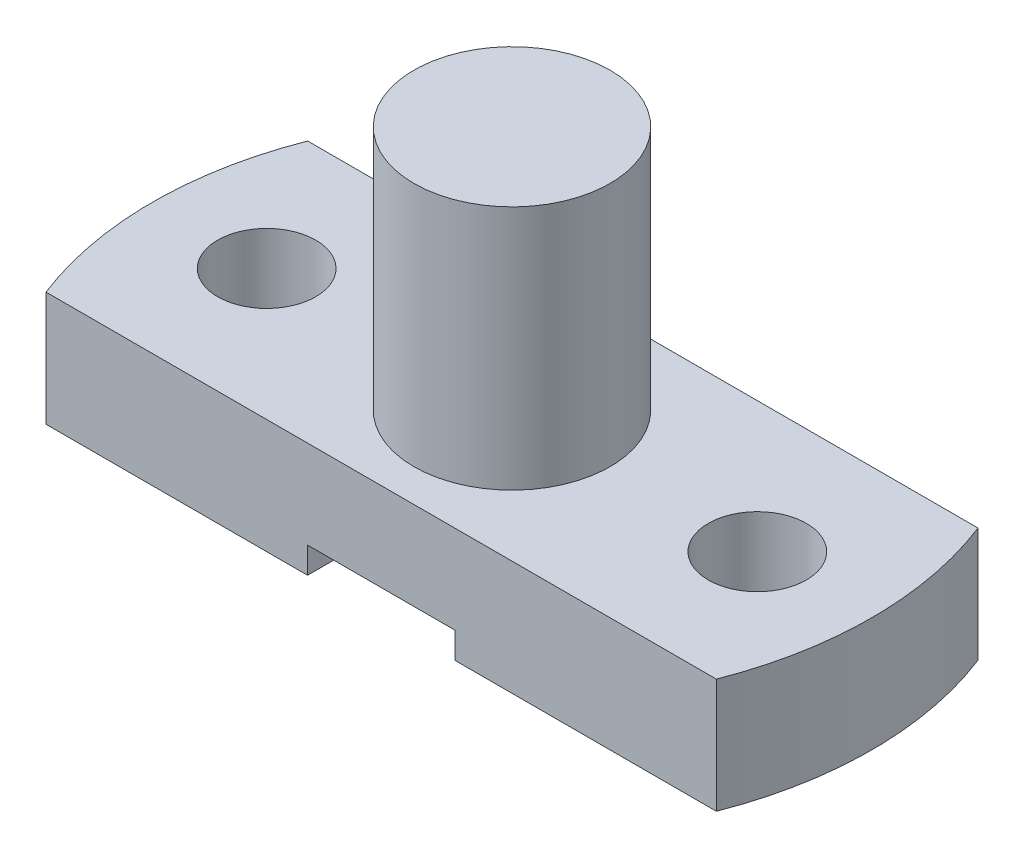
ISO-10303-21;
HEADER;
FILE_DESCRIPTION(('STEP AP214'),'2;1');
FILE_NAME('part.step','',(''),(''),'','','');
FILE_SCHEMA(('AUTOMOTIVE_DESIGN { 1 0 10303 214 1 1 1 1 }'));
ENDSEC;
DATA;
#1=APPLICATION_CONTEXT('core data for automotive mechanical design processes');
#2=APPLICATION_PROTOCOL_DEFINITION('international standard','automotive_design',2000,#1);
#3=PRODUCT_CONTEXT('',#1,'mechanical');
#4=PRODUCT('Part','Part','',(#3));
#5=PRODUCT_RELATED_PRODUCT_CATEGORY('part','',(#4));
#6=PRODUCT_DEFINITION_FORMATION('','',#4);
#7=PRODUCT_DEFINITION_CONTEXT('part definition',#1,'design');
#8=PRODUCT_DEFINITION('design','',#6,#7);
#9=PRODUCT_DEFINITION_SHAPE('','',#8);
#10=(LENGTH_UNIT() NAMED_UNIT(*) SI_UNIT(.MILLI.,.METRE.));
#11=(NAMED_UNIT(*) PLANE_ANGLE_UNIT() SI_UNIT($,.RADIAN.));
#12=(NAMED_UNIT(*) SI_UNIT($,.STERADIAN.) SOLID_ANGLE_UNIT());
#13=UNCERTAINTY_MEASURE_WITH_UNIT(LENGTH_MEASURE(1.E-05),#10,'distance_accuracy_value','');
#14=(GEOMETRIC_REPRESENTATION_CONTEXT(3) GLOBAL_UNCERTAINTY_ASSIGNED_CONTEXT((#13)) GLOBAL_UNIT_ASSIGNED_CONTEXT((#10,
#11,#12)) REPRESENTATION_CONTEXT('',''));
#15=CARTESIAN_POINT('',(0.,0.,0.));
#16=DIRECTION('',(0.,0.,1.));
#17=DIRECTION('',(1.,0.,0.));
#18=AXIS2_PLACEMENT_3D('',#15,#16,#17);
#19=CARTESIAN_POINT('',(0.,0.,0.));
#20=DIRECTION('',(0.,1.,0.));
#21=DIRECTION('',(0.,0.,1.));
#22=AXIS2_PLACEMENT_3D('',#19,#20,#21);
#23=PLANE('',#22);
#24=CARTESIAN_POINT('',(75.,0.,0.));
#25=DIRECTION('',(0.,1.,0.));
#26=DIRECTION('',(0.,0.,1.));
#27=AXIS2_PLACEMENT_3D('',#24,#25,#26);
#28=CIRCLE('',#27,15.);
#29=CARTESIAN_POINT('',(75.,0.,15.));
#30=VERTEX_POINT('',#29);
#31=EDGE_CURVE('E157',#30,#30,#28,.T.);
#32=ORIENTED_EDGE('',*,*,#31,.T.);
#33=EDGE_LOOP('',(#32));
#34=FACE_BOUND('',#33,.T.);
#35=DIRECTION('',(1.,0.,0.));
#36=VECTOR('',#35,1.);
#37=CARTESIAN_POINT('',(-102.469507659596,0.,40.));
#38=LINE('',#37,#36);
#39=CARTESIAN_POINT('',(22.5,0.,40.));
#40=VERTEX_POINT('',#39);
#41=CARTESIAN_POINT('',(102.469507659596,0.,40.));
#42=VERTEX_POINT('',#41);
#43=EDGE_CURVE('E184',#40,#42,#38,.T.);
#44=ORIENTED_EDGE('',*,*,#43,.F.);
#45=DIRECTION('',(0.,0.,1.));
#46=VECTOR('',#45,1.);
#47=CARTESIAN_POINT('',(22.5,0.,40.));
#48=LINE('',#47,#46);
#49=CARTESIAN_POINT('',(22.5,0.,-40.));
#50=VERTEX_POINT('',#49);
#51=EDGE_CURVE('E129',#50,#40,#48,.T.);
#52=ORIENTED_EDGE('',*,*,#51,.F.);
#53=DIRECTION('',(-1.,0.,0.));
#54=VECTOR('',#53,1.);
#55=CARTESIAN_POINT('',(-102.469507659596,0.,-40.));
#56=LINE('',#55,#54);
#57=CARTESIAN_POINT('',(102.469507659596,0.,-40.));
#58=VERTEX_POINT('',#57);
#59=EDGE_CURVE('E172',#58,#50,#56,.T.);
#60=ORIENTED_EDGE('',*,*,#59,.F.);
#61=CARTESIAN_POINT('',(0.,0.,0.));
#62=DIRECTION('',(0.,1.,0.));
#63=DIRECTION('',(0.,0.,1.));
#64=AXIS2_PLACEMENT_3D('',#61,#62,#63);
#65=CIRCLE('',#64,110.);
#66=EDGE_CURVE('E187',#42,#58,#65,.T.);
#67=ORIENTED_EDGE('',*,*,#66,.F.);
#68=EDGE_LOOP('',(#44,#52,#60,#67));
#69=FACE_BOUND('',#68,.T.);
#70=ADVANCED_FACE('F39',(#34,#69),#23,.F.);
#71=CARTESIAN_POINT('',(0.,35.,0.));
#72=DIRECTION('',(0.,1.,0.));
#73=DIRECTION('',(0.,0.,1.));
#74=AXIS2_PLACEMENT_3D('',#71,#72,#73);
#75=PLANE('',#74);
#76=CARTESIAN_POINT('',(0.,35.,0.));
#77=DIRECTION('',(0.,1.,0.));
#78=DIRECTION('',(0.,0.,1.));
#79=AXIS2_PLACEMENT_3D('',#76,#77,#78);
#80=CIRCLE('',#79,30.);
#81=CARTESIAN_POINT('',(0.,35.,30.));
#82=VERTEX_POINT('',#81);
#83=EDGE_CURVE('E148',#82,#82,#80,.T.);
#84=ORIENTED_EDGE('',*,*,#83,.F.);
#85=EDGE_LOOP('',(#84));
#86=FACE_BOUND('',#85,.T.);
#87=CARTESIAN_POINT('',(75.,35.,0.));
#88=DIRECTION('',(0.,1.,0.));
#89=DIRECTION('',(0.,0.,1.));
#90=AXIS2_PLACEMENT_3D('',#87,#88,#89);
#91=CIRCLE('',#90,15.);
#92=CARTESIAN_POINT('',(75.,35.,15.));
#93=VERTEX_POINT('',#92);
#94=EDGE_CURVE('E161',#93,#93,#91,.T.);
#95=ORIENTED_EDGE('',*,*,#94,.F.);
#96=EDGE_LOOP('',(#95));
#97=FACE_BOUND('',#96,.T.);
#98=CARTESIAN_POINT('',(0.,35.,0.));
#99=DIRECTION('',(0.,1.,0.));
#100=DIRECTION('',(0.,0.,1.));
#101=AXIS2_PLACEMENT_3D('',#98,#99,#100);
#102=CIRCLE('',#101,110.);
#103=CARTESIAN_POINT('',(-102.469507659596,35.,-40.));
#104=VERTEX_POINT('',#103);
#105=CARTESIAN_POINT('',(-102.469507659596,35.,40.));
#106=VERTEX_POINT('',#105);
#107=EDGE_CURVE('E169',#104,#106,#102,.T.);
#108=ORIENTED_EDGE('',*,*,#107,.T.);
#109=DIRECTION('',(1.,0.,0.));
#110=VECTOR('',#109,1.);
#111=CARTESIAN_POINT('',(-102.469507659596,35.,40.));
#112=LINE('',#111,#110);
#113=CARTESIAN_POINT('',(102.469507659596,35.,40.));
#114=VERTEX_POINT('',#113);
#115=EDGE_CURVE('E92',#106,#114,#112,.T.);
#116=ORIENTED_EDGE('',*,*,#115,.T.);
#117=CARTESIAN_POINT('',(0.,35.,0.));
#118=DIRECTION('',(0.,1.,0.));
#119=DIRECTION('',(0.,0.,1.));
#120=AXIS2_PLACEMENT_3D('',#117,#118,#119);
#121=CIRCLE('',#120,110.);
#122=CARTESIAN_POINT('',(102.469507659596,35.,-40.));
#123=VERTEX_POINT('',#122);
#124=EDGE_CURVE('E175',#114,#123,#121,.T.);
#125=ORIENTED_EDGE('',*,*,#124,.T.);
#126=DIRECTION('',(-1.,0.,0.));
#127=VECTOR('',#126,1.);
#128=CARTESIAN_POINT('',(-102.469507659596,35.,-40.));
#129=LINE('',#128,#127);
#130=EDGE_CURVE('E64',#123,#104,#129,.T.);
#131=ORIENTED_EDGE('',*,*,#130,.T.);
#132=EDGE_LOOP('',(#108,#116,#125,#131));
#133=FACE_BOUND('',#132,.T.);
#134=CARTESIAN_POINT('',(-75.,35.,0.));
#135=DIRECTION('',(0.,1.,0.));
#136=DIRECTION('',(0.,0.,-1.));
#137=AXIS2_PLACEMENT_3D('',#134,#135,#136);
#138=CIRCLE('',#137,15.);
#139=CARTESIAN_POINT('',(-75.,35.,-15.));
#140=VERTEX_POINT('',#139);
#141=EDGE_CURVE('E153',#140,#140,#138,.T.);
#142=ORIENTED_EDGE('',*,*,#141,.F.);
#143=EDGE_LOOP('',(#142));
#144=FACE_BOUND('',#143,.T.);
#145=ADVANCED_FACE('F215',(#86,#97,#133,#144),#75,.T.);
#146=CARTESIAN_POINT('',(-22.5,0.,-40.));
#147=VERTEX_POINT('',#146);
#148=CARTESIAN_POINT('',(-102.469507659596,0.,-40.));
#149=VERTEX_POINT('',#148);
#150=EDGE_CURVE('E85',#147,#149,#56,.T.);
#151=ORIENTED_EDGE('',*,*,#150,.F.);
#152=DIRECTION('',(0.,0.,-1.));
#153=VECTOR('',#152,1.);
#154=CARTESIAN_POINT('',(-22.5,0.,40.));
#155=LINE('',#154,#153);
#156=CARTESIAN_POINT('',(-22.5,0.,40.));
#157=VERTEX_POINT('',#156);
#158=EDGE_CURVE('E347',#157,#147,#155,.T.);
#159=ORIENTED_EDGE('',*,*,#158,.F.);
#160=CARTESIAN_POINT('',(-102.469507659596,0.,40.));
#161=VERTEX_POINT('',#160);
#162=EDGE_CURVE('E133',#161,#157,#38,.T.);
#163=ORIENTED_EDGE('',*,*,#162,.F.);
#164=CARTESIAN_POINT('',(0.,0.,0.));
#165=DIRECTION('',(0.,1.,0.));
#166=DIRECTION('',(0.,0.,1.));
#167=AXIS2_PLACEMENT_3D('',#164,#165,#166);
#168=CIRCLE('',#167,110.);
#169=EDGE_CURVE('E165',#149,#161,#168,.T.);
#170=ORIENTED_EDGE('',*,*,#169,.F.);
#171=EDGE_LOOP('',(#151,#159,#163,#170));
#172=FACE_BOUND('',#171,.T.);
#173=CARTESIAN_POINT('',(-75.,0.,0.));
#174=DIRECTION('',(0.,1.,0.));
#175=DIRECTION('',(0.,0.,-1.));
#176=AXIS2_PLACEMENT_3D('',#173,#174,#175);
#177=CIRCLE('',#176,15.);
#178=CARTESIAN_POINT('',(-75.,0.,-15.));
#179=VERTEX_POINT('',#178);
#180=EDGE_CURVE('E147',#179,#179,#177,.T.);
#181=ORIENTED_EDGE('',*,*,#180,.T.);
#182=EDGE_LOOP('',(#181));
#183=FACE_BOUND('',#182,.T.);
#184=ADVANCED_FACE('F218',(#172,#183),#23,.F.);
#185=CARTESIAN_POINT('',(0.,35.,0.));
#186=DIRECTION('',(0.,-1.,0.));
#187=DIRECTION('',(0.,0.,-1.));
#188=AXIS2_PLACEMENT_3D('',#185,#186,#187);
#189=CYLINDRICAL_SURFACE('',#188,110.);
#190=ORIENTED_EDGE('',*,*,#169,.T.);
#191=DIRECTION('',(0.,-1.,0.));
#192=VECTOR('',#191,1.);
#193=CARTESIAN_POINT('',(-102.469507659596,35.,40.));
#194=LINE('',#193,#192);
#195=EDGE_CURVE('E11',#106,#161,#194,.T.);
#196=ORIENTED_EDGE('',*,*,#195,.F.);
#197=ORIENTED_EDGE('',*,*,#107,.F.);
#198=DIRECTION('',(0.,-1.,0.));
#199=VECTOR('',#198,1.);
#200=CARTESIAN_POINT('',(-102.469507659596,35.,-40.));
#201=LINE('',#200,#199);
#202=EDGE_CURVE('E180',#104,#149,#201,.T.);
#203=ORIENTED_EDGE('',*,*,#202,.T.);
#204=EDGE_LOOP('',(#190,#196,#197,#203));
#205=FACE_BOUND('',#204,.T.);
#206=ADVANCED_FACE('F41',(#205),#189,.T.);
#207=CARTESIAN_POINT('',(-102.469507659596,35.,40.));
#208=DIRECTION('',(0.,0.,-1.));
#209=DIRECTION('',(-1.,0.,0.));
#210=AXIS2_PLACEMENT_3D('',#207,#208,#209);
#211=PLANE('',#210);
#212=DIRECTION('',(-1.,0.,0.));
#213=VECTOR('',#212,1.);
#214=CARTESIAN_POINT('',(-22.5,8.,40.));
#215=LINE('',#214,#213);
#216=CARTESIAN_POINT('',(22.5,8.,40.));
#217=VERTEX_POINT('',#216);
#218=CARTESIAN_POINT('',(-22.5,8.,40.));
#219=VERTEX_POINT('',#218);
#220=EDGE_CURVE('E120',#217,#219,#215,.T.);
#221=ORIENTED_EDGE('',*,*,#220,.F.);
#222=DIRECTION('',(0.,-1.,0.));
#223=VECTOR('',#222,1.);
#224=CARTESIAN_POINT('',(22.5,8.,40.));
#225=LINE('',#224,#223);
#226=EDGE_CURVE('E152',#217,#40,#225,.T.);
#227=ORIENTED_EDGE('',*,*,#226,.T.);
#228=ORIENTED_EDGE('',*,*,#43,.T.);
#229=DIRECTION('',(0.,-1.,0.));
#230=VECTOR('',#229,1.);
#231=CARTESIAN_POINT('',(102.469507659596,35.,40.));
#232=LINE('',#231,#230);
#233=EDGE_CURVE('E48',#114,#42,#232,.T.);
#234=ORIENTED_EDGE('',*,*,#233,.F.);
#235=ORIENTED_EDGE('',*,*,#115,.F.);
#236=ORIENTED_EDGE('',*,*,#195,.T.);
#237=ORIENTED_EDGE('',*,*,#162,.T.);
#238=DIRECTION('',(0.,-1.,0.));
#239=VECTOR('',#238,1.);
#240=CARTESIAN_POINT('',(-22.5,8.,40.));
#241=LINE('',#240,#239);
#242=EDGE_CURVE('E114',#219,#157,#241,.T.);
#243=ORIENTED_EDGE('',*,*,#242,.F.);
#244=EDGE_LOOP('',(#221,#227,#228,#234,#235,#236,#237,#243));
#245=FACE_BOUND('',#244,.T.);
#246=ADVANCED_FACE('F132',(#245),#211,.F.);
#247=CARTESIAN_POINT('',(0.,35.,0.));
#248=DIRECTION('',(0.,-1.,0.));
#249=DIRECTION('',(0.,0.,-1.));
#250=AXIS2_PLACEMENT_3D('',#247,#248,#249);
#251=CYLINDRICAL_SURFACE('',#250,110.);
#252=ORIENTED_EDGE('',*,*,#66,.T.);
#253=DIRECTION('',(0.,-1.,0.));
#254=VECTOR('',#253,1.);
#255=CARTESIAN_POINT('',(102.469507659596,35.,-40.));
#256=LINE('',#255,#254);
#257=EDGE_CURVE('E195',#123,#58,#256,.T.);
#258=ORIENTED_EDGE('',*,*,#257,.F.);
#259=ORIENTED_EDGE('',*,*,#124,.F.);
#260=ORIENTED_EDGE('',*,*,#233,.T.);
#261=EDGE_LOOP('',(#252,#258,#259,#260));
#262=FACE_BOUND('',#261,.T.);
#263=ADVANCED_FACE('F203',(#262),#251,.T.);
#264=CARTESIAN_POINT('',(-102.469507659596,35.,-40.));
#265=DIRECTION('',(0.,0.,1.));
#266=DIRECTION('',(1.,0.,0.));
#267=AXIS2_PLACEMENT_3D('',#264,#265,#266);
#268=PLANE('',#267);
#269=ORIENTED_EDGE('',*,*,#59,.T.);
#270=DIRECTION('',(0.,-1.,0.));
#271=VECTOR('',#270,1.);
#272=CARTESIAN_POINT('',(22.5,8.,-40.));
#273=LINE('',#272,#271);
#274=CARTESIAN_POINT('',(22.5,8.,-40.));
#275=VERTEX_POINT('',#274);
#276=EDGE_CURVE('E138',#275,#50,#273,.T.);
#277=ORIENTED_EDGE('',*,*,#276,.F.);
#278=DIRECTION('',(1.,0.,0.));
#279=VECTOR('',#278,1.);
#280=CARTESIAN_POINT('',(22.5,8.,-40.));
#281=LINE('',#280,#279);
#282=CARTESIAN_POINT('',(-22.5,8.,-40.));
#283=VERTEX_POINT('',#282);
#284=EDGE_CURVE('E119',#283,#275,#281,.T.);
#285=ORIENTED_EDGE('',*,*,#284,.F.);
#286=DIRECTION('',(0.,-1.,0.));
#287=VECTOR('',#286,1.);
#288=CARTESIAN_POINT('',(-22.5,8.,-40.));
#289=LINE('',#288,#287);
#290=EDGE_CURVE('E116',#283,#147,#289,.T.);
#291=ORIENTED_EDGE('',*,*,#290,.T.);
#292=ORIENTED_EDGE('',*,*,#150,.T.);
#293=ORIENTED_EDGE('',*,*,#202,.F.);
#294=ORIENTED_EDGE('',*,*,#130,.F.);
#295=ORIENTED_EDGE('',*,*,#257,.T.);
#296=EDGE_LOOP('',(#269,#277,#285,#291,#292,#293,#294,#295));
#297=FACE_BOUND('',#296,.T.);
#298=ADVANCED_FACE('F210',(#297),#268,.F.);
#299=CARTESIAN_POINT('',(75.,35.,0.));
#300=DIRECTION('',(0.,-1.,0.));
#301=DIRECTION('',(0.,0.,-1.));
#302=AXIS2_PLACEMENT_3D('',#299,#300,#301);
#303=CYLINDRICAL_SURFACE('',#302,15.);
#304=ORIENTED_EDGE('',*,*,#94,.T.);
#305=EDGE_LOOP('',(#304));
#306=FACE_BOUND('',#305,.T.);
#307=ORIENTED_EDGE('',*,*,#31,.F.);
#308=EDGE_LOOP('',(#307));
#309=FACE_BOUND('',#308,.T.);
#310=ADVANCED_FACE('F227',(#306,#309),#303,.F.);
#311=CARTESIAN_POINT('',(-75.,35.,0.));
#312=DIRECTION('',(0.,-1.,0.));
#313=DIRECTION('',(0.,0.,-1.));
#314=AXIS2_PLACEMENT_3D('',#311,#312,#313);
#315=CYLINDRICAL_SURFACE('',#314,15.);
#316=ORIENTED_EDGE('',*,*,#141,.T.);
#317=EDGE_LOOP('',(#316));
#318=FACE_BOUND('',#317,.T.);
#319=ORIENTED_EDGE('',*,*,#180,.F.);
#320=EDGE_LOOP('',(#319));
#321=FACE_BOUND('',#320,.T.);
#322=ADVANCED_FACE('F223',(#318,#321),#315,.F.);
#323=CARTESIAN_POINT('',(0.,110.,0.));
#324=DIRECTION('',(0.,-1.,0.));
#325=DIRECTION('',(0.,0.,-1.));
#326=AXIS2_PLACEMENT_3D('',#323,#324,#325);
#327=CYLINDRICAL_SURFACE('',#326,30.);
#328=CARTESIAN_POINT('',(0.,110.,0.));
#329=DIRECTION('',(0.,1.,0.));
#330=DIRECTION('',(0.,0.,1.));
#331=AXIS2_PLACEMENT_3D('',#328,#329,#330);
#332=CIRCLE('',#331,30.);
#333=CARTESIAN_POINT('',(0.,110.,30.));
#334=VERTEX_POINT('',#333);
#335=EDGE_CURVE('E143',#334,#334,#332,.T.);
#336=ORIENTED_EDGE('',*,*,#335,.F.);
#337=EDGE_LOOP('',(#336));
#338=FACE_BOUND('',#337,.T.);
#339=ORIENTED_EDGE('',*,*,#83,.T.);
#340=EDGE_LOOP('',(#339));
#341=FACE_BOUND('',#340,.T.);
#342=ADVANCED_FACE('F226',(#338,#341),#327,.T.);
#343=CARTESIAN_POINT('',(0.,110.,0.));
#344=DIRECTION('',(0.,1.,0.));
#345=DIRECTION('',(0.,0.,1.));
#346=AXIS2_PLACEMENT_3D('',#343,#344,#345);
#347=PLANE('',#346);
#348=ORIENTED_EDGE('',*,*,#335,.T.);
#349=EDGE_LOOP('',(#348));
#350=FACE_BOUND('',#349,.T.);
#351=ADVANCED_FACE('F253',(#350),#347,.T.);
#352=CARTESIAN_POINT('',(22.5,8.,40.));
#353=DIRECTION('',(1.,0.,0.));
#354=DIRECTION('',(0.,0.,-1.));
#355=AXIS2_PLACEMENT_3D('',#352,#353,#354);
#356=PLANE('',#355);
#357=ORIENTED_EDGE('',*,*,#51,.T.);
#358=ORIENTED_EDGE('',*,*,#226,.F.);
#359=DIRECTION('',(0.,0.,1.));
#360=VECTOR('',#359,1.);
#361=CARTESIAN_POINT('',(22.5,8.,40.));
#362=LINE('',#361,#360);
#363=EDGE_CURVE('E126',#275,#217,#362,.T.);
#364=ORIENTED_EDGE('',*,*,#363,.F.);
#365=ORIENTED_EDGE('',*,*,#276,.T.);
#366=EDGE_LOOP('',(#357,#358,#364,#365));
#367=FACE_BOUND('',#366,.T.);
#368=ADVANCED_FACE('F257',(#367),#356,.F.);
#369=CARTESIAN_POINT('',(-22.5,8.,40.));
#370=DIRECTION('',(-1.,0.,0.));
#371=DIRECTION('',(0.,0.,1.));
#372=AXIS2_PLACEMENT_3D('',#369,#370,#371);
#373=PLANE('',#372);
#374=ORIENTED_EDGE('',*,*,#158,.T.);
#375=ORIENTED_EDGE('',*,*,#290,.F.);
#376=DIRECTION('',(0.,0.,-1.));
#377=VECTOR('',#376,1.);
#378=CARTESIAN_POINT('',(-22.5,8.,40.));
#379=LINE('',#378,#377);
#380=EDGE_CURVE('E55',#219,#283,#379,.T.);
#381=ORIENTED_EDGE('',*,*,#380,.F.);
#382=ORIENTED_EDGE('',*,*,#242,.T.);
#383=EDGE_LOOP('',(#374,#375,#381,#382));
#384=FACE_BOUND('',#383,.T.);
#385=ADVANCED_FACE('F112',(#384),#373,.F.);
#386=CARTESIAN_POINT('',(0.,8.,0.));
#387=DIRECTION('',(0.,1.,0.));
#388=DIRECTION('',(0.,0.,1.));
#389=AXIS2_PLACEMENT_3D('',#386,#387,#388);
#390=PLANE('',#389);
#391=ORIENTED_EDGE('',*,*,#220,.T.);
#392=ORIENTED_EDGE('',*,*,#380,.T.);
#393=ORIENTED_EDGE('',*,*,#284,.T.);
#394=ORIENTED_EDGE('',*,*,#363,.T.);
#395=EDGE_LOOP('',(#391,#392,#393,#394));
#396=FACE_BOUND('',#395,.T.);
#397=ADVANCED_FACE('F124',(#396),#390,.F.);
#398=CLOSED_SHELL('',(#70,#145,#184,#206,#246,#263,#298,#310,#322,#342,#351,#368,#385,#397));
#399=MANIFOLD_SOLID_BREP('B2',#398);
#400=ADVANCED_BREP_SHAPE_REPRESENTATION('',(#18,#399),#14);
#401=SHAPE_DEFINITION_REPRESENTATION(#9,#400);
ENDSEC;
END-ISO-10303-21;
